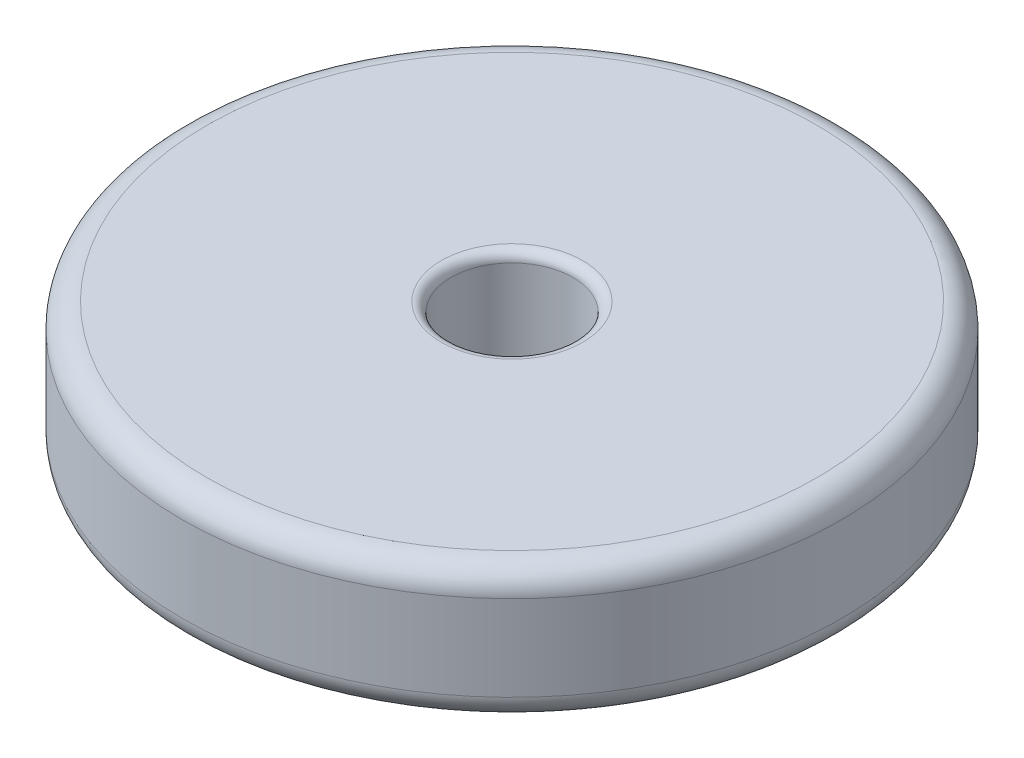
ISO-10303-21;
HEADER;
FILE_DESCRIPTION(('STEP AP214'),'2;1');
FILE_NAME('part.step','',(''),(''),'','','');
FILE_SCHEMA(('AUTOMOTIVE_DESIGN { 1 0 10303 214 1 1 1 1 }'));
ENDSEC;
DATA;
#1=APPLICATION_CONTEXT('core data for automotive mechanical design processes');
#2=APPLICATION_PROTOCOL_DEFINITION('international standard','automotive_design',2000,#1);
#3=PRODUCT_CONTEXT('',#1,'mechanical');
#4=PRODUCT('Part','Part','',(#3));
#5=PRODUCT_RELATED_PRODUCT_CATEGORY('part','',(#4));
#6=PRODUCT_DEFINITION_FORMATION('','',#4);
#7=PRODUCT_DEFINITION_CONTEXT('part definition',#1,'design');
#8=PRODUCT_DEFINITION('design','',#6,#7);
#9=PRODUCT_DEFINITION_SHAPE('','',#8);
#10=(LENGTH_UNIT() NAMED_UNIT(*) SI_UNIT(.MILLI.,.METRE.));
#11=(NAMED_UNIT(*) PLANE_ANGLE_UNIT() SI_UNIT($,.RADIAN.));
#12=(NAMED_UNIT(*) SI_UNIT($,.STERADIAN.) SOLID_ANGLE_UNIT());
#13=UNCERTAINTY_MEASURE_WITH_UNIT(LENGTH_MEASURE(1.E-05),#10,'distance_accuracy_value','');
#14=(GEOMETRIC_REPRESENTATION_CONTEXT(3) GLOBAL_UNCERTAINTY_ASSIGNED_CONTEXT((#13)) GLOBAL_UNIT_ASSIGNED_CONTEXT((#10,
#11,#12)) REPRESENTATION_CONTEXT('',''));
#15=CARTESIAN_POINT('',(0.,0.,0.));
#16=DIRECTION('',(0.,0.,1.));
#17=DIRECTION('',(1.,0.,0.));
#18=AXIS2_PLACEMENT_3D('',#15,#16,#17);
#19=CARTESIAN_POINT('',(0.,34.925,0.));
#20=DIRECTION('',(0.,1.,0.));
#21=DIRECTION('',(0.,0.,1.));
#22=AXIS2_PLACEMENT_3D('',#19,#20,#21);
#23=PLANE('',#22);
#24=CARTESIAN_POINT('',(0.,34.925,0.));
#25=DIRECTION('',(0.,1.,0.));
#26=DIRECTION('',(0.,0.,1.));
#27=AXIS2_PLACEMENT_3D('',#24,#25,#26);
#28=CIRCLE('',#27,18.415);
#29=CARTESIAN_POINT('',(0.,34.925,18.415));
#30=VERTEX_POINT('',#29);
#31=EDGE_CURVE('E10',#30,#30,#28,.F.);
#32=ORIENTED_EDGE('',*,*,#31,.T.);
#33=EDGE_LOOP('',(#32));
#34=FACE_BOUND('',#33,.T.);
#35=CARTESIAN_POINT('',(0.,34.925,0.));
#36=DIRECTION('',(0.,1.,0.));
#37=DIRECTION('',(0.,0.,1.));
#38=AXIS2_PLACEMENT_3D('',#35,#36,#37);
#39=CIRCLE('',#38,79.375);
#40=CARTESIAN_POINT('',(0.,34.925,79.375));
#41=VERTEX_POINT('',#40);
#42=EDGE_CURVE('E52',#41,#41,#39,.T.);
#43=ORIENTED_EDGE('',*,*,#42,.T.);
#44=EDGE_LOOP('',(#43));
#45=FACE_BOUND('',#44,.T.);
#46=ADVANCED_FACE('F32',(#34,#45),#23,.T.);
#47=CARTESIAN_POINT('',(0.,0.,0.));
#48=DIRECTION('',(0.,1.,0.));
#49=DIRECTION('',(0.,0.,1.));
#50=AXIS2_PLACEMENT_3D('',#47,#48,#49);
#51=PLANE('',#50);
#52=CARTESIAN_POINT('',(0.,0.,0.));
#53=DIRECTION('',(0.,1.,0.));
#54=DIRECTION('',(0.,0.,1.));
#55=AXIS2_PLACEMENT_3D('',#52,#53,#54);
#56=CIRCLE('',#55,18.415);
#57=CARTESIAN_POINT('',(0.,0.,18.415));
#58=VERTEX_POINT('',#57);
#59=EDGE_CURVE('E47',#58,#58,#56,.T.);
#60=ORIENTED_EDGE('',*,*,#59,.T.);
#61=EDGE_LOOP('',(#60));
#62=FACE_BOUND('',#61,.T.);
#63=CARTESIAN_POINT('',(0.,0.,0.));
#64=DIRECTION('',(0.,1.,0.));
#65=DIRECTION('',(0.,0.,1.));
#66=AXIS2_PLACEMENT_3D('',#63,#64,#65);
#67=CIRCLE('',#66,79.375);
#68=CARTESIAN_POINT('',(0.,0.,79.375));
#69=VERTEX_POINT('',#68);
#70=EDGE_CURVE('E55',#69,#69,#67,.F.);
#71=ORIENTED_EDGE('',*,*,#70,.T.);
#72=EDGE_LOOP('',(#71));
#73=FACE_BOUND('',#72,.T.);
#74=ADVANCED_FACE('F76',(#62,#73),#51,.F.);
#75=CARTESIAN_POINT('',(0.,34.925,0.));
#76=DIRECTION('',(0.,-1.,0.));
#77=DIRECTION('',(0.,0.,-1.));
#78=AXIS2_PLACEMENT_3D('',#75,#76,#77);
#79=CYLINDRICAL_SURFACE('',#78,85.725);
#80=CARTESIAN_POINT('',(0.,6.35,0.));
#81=DIRECTION('',(0.,1.,0.));
#82=DIRECTION('',(0.,0.,1.));
#83=AXIS2_PLACEMENT_3D('',#80,#81,#82);
#84=CIRCLE('',#83,85.725);
#85=CARTESIAN_POINT('',(0.,6.35,85.725));
#86=VERTEX_POINT('',#85);
#87=EDGE_CURVE('E58',#86,#86,#84,.T.);
#88=ORIENTED_EDGE('',*,*,#87,.T.);
#89=EDGE_LOOP('',(#88));
#90=FACE_BOUND('',#89,.T.);
#91=CARTESIAN_POINT('',(0.,28.575,0.));
#92=DIRECTION('',(0.,1.,0.));
#93=DIRECTION('',(0.,0.,1.));
#94=AXIS2_PLACEMENT_3D('',#91,#92,#93);
#95=CIRCLE('',#94,85.725);
#96=CARTESIAN_POINT('',(0.,28.575,85.725));
#97=VERTEX_POINT('',#96);
#98=EDGE_CURVE('E61',#97,#97,#95,.F.);
#99=ORIENTED_EDGE('',*,*,#98,.T.);
#100=EDGE_LOOP('',(#99));
#101=FACE_BOUND('',#100,.T.);
#102=ADVANCED_FACE('F65',(#90,#101),#79,.T.);
#103=CARTESIAN_POINT('',(0.,34.925,0.));
#104=DIRECTION('',(0.,-1.,0.));
#105=DIRECTION('',(0.,0.,-1.));
#106=AXIS2_PLACEMENT_3D('',#103,#104,#105);
#107=CYLINDRICAL_SURFACE('',#106,15.875);
#108=CARTESIAN_POINT('',(0.,2.54,0.));
#109=DIRECTION('',(0.,1.,0.));
#110=DIRECTION('',(0.,0.,1.));
#111=AXIS2_PLACEMENT_3D('',#108,#109,#110);
#112=CIRCLE('',#111,15.875);
#113=CARTESIAN_POINT('',(0.,2.54,15.875));
#114=VERTEX_POINT('',#113);
#115=EDGE_CURVE('E39',#114,#114,#112,.F.);
#116=ORIENTED_EDGE('',*,*,#115,.T.);
#117=EDGE_LOOP('',(#116));
#118=FACE_BOUND('',#117,.T.);
#119=CARTESIAN_POINT('',(0.,32.385,0.));
#120=DIRECTION('',(0.,1.,0.));
#121=DIRECTION('',(0.,0.,1.));
#122=AXIS2_PLACEMENT_3D('',#119,#120,#121);
#123=CIRCLE('',#122,15.875);
#124=CARTESIAN_POINT('',(0.,32.385,15.875));
#125=VERTEX_POINT('',#124);
#126=EDGE_CURVE('E43',#125,#125,#123,.T.);
#127=ORIENTED_EDGE('',*,*,#126,.T.);
#128=EDGE_LOOP('',(#127));
#129=FACE_BOUND('',#128,.T.);
#130=ADVANCED_FACE('F84',(#118,#129),#107,.F.);
#131=CARTESIAN_POINT('',(0.,6.35,0.));
#132=DIRECTION('',(0.,1.,0.));
#133=DIRECTION('',(0.,0.,1.));
#134=AXIS2_PLACEMENT_3D('',#131,#132,#133);
#135=TOROIDAL_SURFACE('',#134,79.375,6.35);
#136=ORIENTED_EDGE('',*,*,#70,.F.);
#137=EDGE_LOOP('',(#136));
#138=FACE_BOUND('',#137,.T.);
#139=ORIENTED_EDGE('',*,*,#87,.F.);
#140=EDGE_LOOP('',(#139));
#141=FACE_BOUND('',#140,.T.);
#142=ADVANCED_FACE('F71',(#138,#141),#135,.T.);
#143=CARTESIAN_POINT('',(0.,28.575,0.));
#144=DIRECTION('',(0.,1.,0.));
#145=DIRECTION('',(0.,0.,1.));
#146=AXIS2_PLACEMENT_3D('',#143,#144,#145);
#147=TOROIDAL_SURFACE('',#146,79.375,6.35);
#148=ORIENTED_EDGE('',*,*,#98,.F.);
#149=EDGE_LOOP('',(#148));
#150=FACE_BOUND('',#149,.T.);
#151=ORIENTED_EDGE('',*,*,#42,.F.);
#152=EDGE_LOOP('',(#151));
#153=FACE_BOUND('',#152,.T.);
#154=ADVANCED_FACE('F67',(#150,#153),#147,.T.);
#155=CARTESIAN_POINT('',(0.,2.54,0.));
#156=DIRECTION('',(0.,1.,0.));
#157=DIRECTION('',(0.,0.,1.));
#158=AXIS2_PLACEMENT_3D('',#155,#156,#157);
#159=TOROIDAL_SURFACE('',#158,18.415,2.54);
#160=ORIENTED_EDGE('',*,*,#115,.F.);
#161=EDGE_LOOP('',(#160));
#162=FACE_BOUND('',#161,.T.);
#163=ORIENTED_EDGE('',*,*,#59,.F.);
#164=EDGE_LOOP('',(#163));
#165=FACE_BOUND('',#164,.T.);
#166=ADVANCED_FACE('F70',(#162,#165),#159,.T.);
#167=CARTESIAN_POINT('',(0.,32.385,0.));
#168=DIRECTION('',(0.,1.,0.));
#169=DIRECTION('',(0.,0.,1.));
#170=AXIS2_PLACEMENT_3D('',#167,#168,#169);
#171=TOROIDAL_SURFACE('',#170,18.415,2.54);
#172=ORIENTED_EDGE('',*,*,#31,.F.);
#173=EDGE_LOOP('',(#172));
#174=FACE_BOUND('',#173,.T.);
#175=ORIENTED_EDGE('',*,*,#126,.F.);
#176=EDGE_LOOP('',(#175));
#177=FACE_BOUND('',#176,.T.);
#178=ADVANCED_FACE('F34',(#174,#177),#171,.T.);
#179=CLOSED_SHELL('',(#46,#74,#102,#130,#142,#154,#166,#178));
#180=MANIFOLD_SOLID_BREP('B2',#179);
#181=ADVANCED_BREP_SHAPE_REPRESENTATION('',(#18,#180),#14);
#182=SHAPE_DEFINITION_REPRESENTATION(#9,#181);
ENDSEC;
END-ISO-10303-21;
